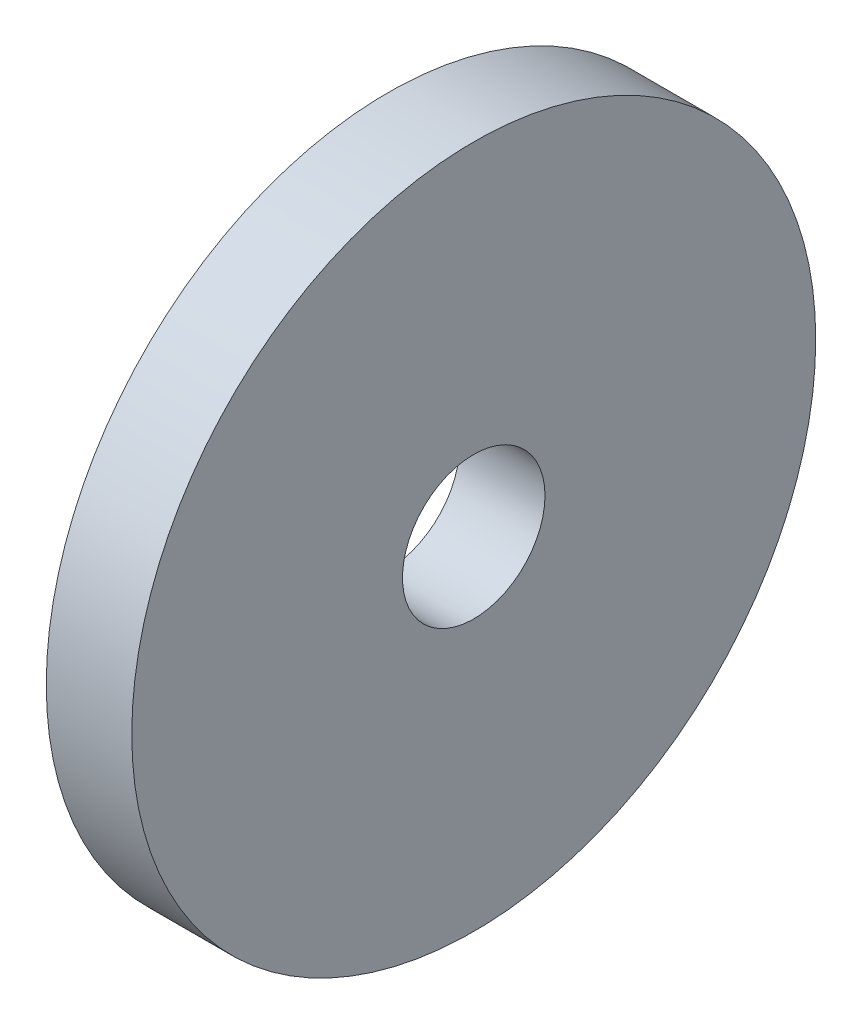
ISO-10303-21;
HEADER;
FILE_DESCRIPTION(('STEP AP214'),'2;1');
FILE_NAME('part.step','',(''),(''),'','','');
FILE_SCHEMA(('AUTOMOTIVE_DESIGN { 1 0 10303 214 1 1 1 1 }'));
ENDSEC;
DATA;
#1=APPLICATION_CONTEXT('core data for automotive mechanical design processes');
#2=APPLICATION_PROTOCOL_DEFINITION('international standard','automotive_design',2000,#1);
#3=PRODUCT_CONTEXT('',#1,'mechanical');
#4=PRODUCT('Part','Part','',(#3));
#5=PRODUCT_RELATED_PRODUCT_CATEGORY('part','',(#4));
#6=PRODUCT_DEFINITION_FORMATION('','',#4);
#7=PRODUCT_DEFINITION_CONTEXT('part definition',#1,'design');
#8=PRODUCT_DEFINITION('design','',#6,#7);
#9=PRODUCT_DEFINITION_SHAPE('','',#8);
#10=(LENGTH_UNIT() NAMED_UNIT(*) SI_UNIT(.MILLI.,.METRE.));
#11=(NAMED_UNIT(*) PLANE_ANGLE_UNIT() SI_UNIT($,.RADIAN.));
#12=(NAMED_UNIT(*) SI_UNIT($,.STERADIAN.) SOLID_ANGLE_UNIT());
#13=UNCERTAINTY_MEASURE_WITH_UNIT(LENGTH_MEASURE(1.E-05),#10,'distance_accuracy_value','');
#14=(GEOMETRIC_REPRESENTATION_CONTEXT(3) GLOBAL_UNCERTAINTY_ASSIGNED_CONTEXT((#13)) GLOBAL_UNIT_ASSIGNED_CONTEXT((#10,
#11,#12)) REPRESENTATION_CONTEXT('',''));
#15=CARTESIAN_POINT('',(0.,0.,0.));
#16=DIRECTION('',(0.,0.,1.));
#17=DIRECTION('',(1.,0.,0.));
#18=AXIS2_PLACEMENT_3D('',#15,#16,#17);
#19=CARTESIAN_POINT('',(3.,0.,0.));
#20=DIRECTION('',(-1.,0.,0.));
#21=DIRECTION('',(0.,0.,1.));
#22=AXIS2_PLACEMENT_3D('',#19,#20,#21);
#23=CYLINDRICAL_SURFACE('',#22,12.);
#24=CARTESIAN_POINT('',(3.,0.,0.));
#25=DIRECTION('',(1.,0.,0.));
#26=DIRECTION('',(0.,0.,-1.));
#27=AXIS2_PLACEMENT_3D('',#24,#25,#26);
#28=CIRCLE('',#27,12.);
#29=CARTESIAN_POINT('',(3.,0.,-12.));
#30=VERTEX_POINT('',#29);
#31=EDGE_CURVE('E10',#30,#30,#28,.T.);
#32=ORIENTED_EDGE('',*,*,#31,.F.);
#33=EDGE_LOOP('',(#32));
#34=FACE_BOUND('',#33,.T.);
#35=CARTESIAN_POINT('',(0.,0.,0.));
#36=DIRECTION('',(1.,0.,0.));
#37=DIRECTION('',(0.,0.,-1.));
#38=AXIS2_PLACEMENT_3D('',#35,#36,#37);
#39=CIRCLE('',#38,12.);
#40=CARTESIAN_POINT('',(0.,0.,-12.));
#41=VERTEX_POINT('',#40);
#42=EDGE_CURVE('E44',#41,#41,#39,.T.);
#43=ORIENTED_EDGE('',*,*,#42,.T.);
#44=EDGE_LOOP('',(#43));
#45=FACE_BOUND('',#44,.T.);
#46=ADVANCED_FACE('F41',(#34,#45),#23,.T.);
#47=CARTESIAN_POINT('',(3.,0.,0.));
#48=DIRECTION('',(1.,0.,0.));
#49=DIRECTION('',(0.,0.,-1.));
#50=AXIS2_PLACEMENT_3D('',#47,#48,#49);
#51=PLANE('',#50);
#52=CARTESIAN_POINT('',(3.,0.,0.));
#53=DIRECTION('',(1.,0.,0.));
#54=DIRECTION('',(0.,0.,-1.));
#55=AXIS2_PLACEMENT_3D('',#52,#53,#54);
#56=CIRCLE('',#55,2.5);
#57=CARTESIAN_POINT('',(3.,0.,-2.5));
#58=VERTEX_POINT('',#57);
#59=EDGE_CURVE('E55',#58,#58,#56,.T.);
#60=ORIENTED_EDGE('',*,*,#59,.F.);
#61=EDGE_LOOP('',(#60));
#62=FACE_BOUND('',#61,.T.);
#63=ORIENTED_EDGE('',*,*,#31,.T.);
#64=EDGE_LOOP('',(#63));
#65=FACE_BOUND('',#64,.T.);
#66=ADVANCED_FACE('F72',(#62,#65),#51,.T.);
#67=CARTESIAN_POINT('',(0.,0.,0.));
#68=DIRECTION('',(1.,0.,0.));
#69=DIRECTION('',(0.,0.,-1.));
#70=AXIS2_PLACEMENT_3D('',#67,#68,#69);
#71=PLANE('',#70);
#72=CARTESIAN_POINT('',(0.,0.,0.));
#73=DIRECTION('',(1.,0.,0.));
#74=DIRECTION('',(0.,0.,-1.));
#75=AXIS2_PLACEMENT_3D('',#72,#73,#74);
#76=CIRCLE('',#75,2.5);
#77=CARTESIAN_POINT('',(0.,0.,-2.5));
#78=VERTEX_POINT('',#77);
#79=EDGE_CURVE('E53',#78,#78,#76,.T.);
#80=ORIENTED_EDGE('',*,*,#79,.T.);
#81=EDGE_LOOP('',(#80));
#82=FACE_BOUND('',#81,.T.);
#83=ORIENTED_EDGE('',*,*,#42,.F.);
#84=EDGE_LOOP('',(#83));
#85=FACE_BOUND('',#84,.T.);
#86=ADVANCED_FACE('F63',(#82,#85),#71,.F.);
#87=CARTESIAN_POINT('',(0.,0.,0.));
#88=DIRECTION('',(1.,0.,0.));
#89=DIRECTION('',(0.,0.,-1.));
#90=AXIS2_PLACEMENT_3D('',#87,#88,#89);
#91=CYLINDRICAL_SURFACE('',#90,2.5);
#92=ORIENTED_EDGE('',*,*,#79,.F.);
#93=EDGE_LOOP('',(#92));
#94=FACE_BOUND('',#93,.T.);
#95=ORIENTED_EDGE('',*,*,#59,.T.);
#96=EDGE_LOOP('',(#95));
#97=FACE_BOUND('',#96,.T.);
#98=ADVANCED_FACE('F66',(#94,#97),#91,.F.);
#99=CLOSED_SHELL('',(#46,#66,#86,#98));
#100=MANIFOLD_SOLID_BREP('B2',#99);
#101=ADVANCED_BREP_SHAPE_REPRESENTATION('',(#18,#100),#14);
#102=SHAPE_DEFINITION_REPRESENTATION(#9,#101);
ENDSEC;
END-ISO-10303-21;
